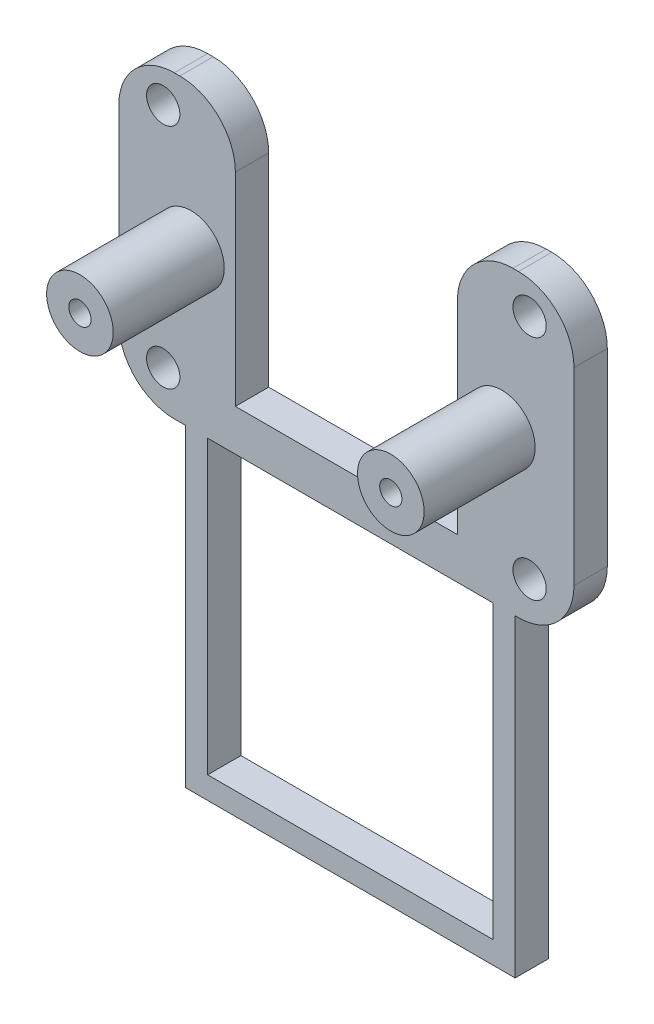
ISO-10303-21;
HEADER;
FILE_DESCRIPTION(('STEP AP214'),'2;1');
FILE_NAME('part.step','',(''),(''),'','','');
FILE_SCHEMA(('AUTOMOTIVE_DESIGN { 1 0 10303 214 1 1 1 1 }'));
ENDSEC;
DATA;
#1=APPLICATION_CONTEXT('core data for automotive mechanical design processes');
#2=APPLICATION_PROTOCOL_DEFINITION('international standard','automotive_design',2000,#1);
#3=PRODUCT_CONTEXT('',#1,'mechanical');
#4=PRODUCT('Part','Part','',(#3));
#5=PRODUCT_RELATED_PRODUCT_CATEGORY('part','',(#4));
#6=PRODUCT_DEFINITION_FORMATION('','',#4);
#7=PRODUCT_DEFINITION_CONTEXT('part definition',#1,'design');
#8=PRODUCT_DEFINITION('design','',#6,#7);
#9=PRODUCT_DEFINITION_SHAPE('','',#8);
#10=(LENGTH_UNIT() NAMED_UNIT(*) SI_UNIT(.MILLI.,.METRE.));
#11=(NAMED_UNIT(*) PLANE_ANGLE_UNIT() SI_UNIT($,.RADIAN.));
#12=(NAMED_UNIT(*) SI_UNIT($,.STERADIAN.) SOLID_ANGLE_UNIT());
#13=UNCERTAINTY_MEASURE_WITH_UNIT(LENGTH_MEASURE(1.E-05),#10,'distance_accuracy_value','');
#14=(GEOMETRIC_REPRESENTATION_CONTEXT(3) GLOBAL_UNCERTAINTY_ASSIGNED_CONTEXT((#13)) GLOBAL_UNIT_ASSIGNED_CONTEXT((#10,
#11,#12)) REPRESENTATION_CONTEXT('',''));
#15=CARTESIAN_POINT('',(0.,0.,0.));
#16=DIRECTION('',(0.,0.,1.));
#17=DIRECTION('',(1.,0.,0.));
#18=AXIS2_PLACEMENT_3D('',#15,#16,#17);
#19=CARTESIAN_POINT('',(0.,0.,3.));
#20=DIRECTION('',(0.,1.,0.));
#21=DIRECTION('',(0.,0.,1.));
#22=AXIS2_PLACEMENT_3D('',#19,#20,#21);
#23=PLANE('',#22);
#24=DIRECTION('',(0.,0.,1.));
#25=VECTOR('',#24,1.);
#26=CARTESIAN_POINT('',(35.7,0.,0.));
#27=LINE('',#26,#25);
#28=CARTESIAN_POINT('',(35.7,0.,0.));
#29=VERTEX_POINT('',#28);
#30=CARTESIAN_POINT('',(35.7,0.,3.));
#31=VERTEX_POINT('',#30);
#32=EDGE_CURVE('E234',#29,#31,#27,.T.);
#33=ORIENTED_EDGE('',*,*,#32,.F.);
#34=DIRECTION('',(1.,0.,0.));
#35=VECTOR('',#34,1.);
#36=CARTESIAN_POINT('',(0.,0.,0.));
#37=LINE('',#36,#35);
#38=CARTESIAN_POINT('',(36.,0.,0.));
#39=VERTEX_POINT('',#38);
#40=EDGE_CURVE('E330',#29,#39,#37,.T.);
#41=ORIENTED_EDGE('',*,*,#40,.T.);
#42=DIRECTION('',(0.,0.,-1.));
#43=VECTOR('',#42,1.);
#44=CARTESIAN_POINT('',(36.,0.,3.));
#45=LINE('',#44,#43);
#46=CARTESIAN_POINT('',(36.,0.,3.));
#47=VERTEX_POINT('',#46);
#48=EDGE_CURVE('E367',#39,#47,#45,.F.);
#49=ORIENTED_EDGE('',*,*,#48,.T.);
#50=DIRECTION('',(1.,0.,0.));
#51=VECTOR('',#50,1.);
#52=CARTESIAN_POINT('',(0.,0.,3.));
#53=LINE('',#52,#51);
#54=EDGE_CURVE('E53',#31,#47,#53,.T.);
#55=ORIENTED_EDGE('',*,*,#54,.F.);
#56=EDGE_LOOP('',(#33,#41,#49,#55));
#57=FACE_BOUND('',#56,.T.);
#58=ADVANCED_FACE('F38',(#57),#23,.F.);
#59=DIRECTION('',(0.,0.,1.));
#60=VECTOR('',#59,1.);
#61=CARTESIAN_POINT('',(8.,0.,0.));
#62=LINE('',#61,#60);
#63=CARTESIAN_POINT('',(8.,0.,0.));
#64=VERTEX_POINT('',#63);
#65=CARTESIAN_POINT('',(8.,0.,3.));
#66=VERTEX_POINT('',#65);
#67=EDGE_CURVE('E244',#64,#66,#62,.T.);
#68=ORIENTED_EDGE('',*,*,#67,.F.);
#69=CARTESIAN_POINT('',(33.7,0.,0.));
#70=VERTEX_POINT('',#69);
#71=EDGE_CURVE('E334',#64,#70,#37,.T.);
#72=ORIENTED_EDGE('',*,*,#71,.T.);
#73=DIRECTION('',(0.,0.,1.));
#74=VECTOR('',#73,1.);
#75=CARTESIAN_POINT('',(33.7,0.,0.));
#76=LINE('',#75,#74);
#77=CARTESIAN_POINT('',(33.7,0.,3.));
#78=VERTEX_POINT('',#77);
#79=EDGE_CURVE('E61',#70,#78,#76,.T.);
#80=ORIENTED_EDGE('',*,*,#79,.T.);
#81=EDGE_CURVE('E301',#66,#78,#53,.T.);
#82=ORIENTED_EDGE('',*,*,#81,.F.);
#83=EDGE_LOOP('',(#68,#72,#80,#82));
#84=FACE_BOUND('',#83,.T.);
#85=ADVANCED_FACE('F487',(#84),#23,.F.);
#86=CARTESIAN_POINT('',(30.5,0.,3.));
#87=DIRECTION('',(-1.,0.,0.));
#88=DIRECTION('',(0.,0.,1.));
#89=AXIS2_PLACEMENT_3D('',#86,#87,#88);
#90=PLANE('',#89);
#91=DIRECTION('',(0.,1.,0.));
#92=VECTOR('',#91,1.);
#93=CARTESIAN_POINT('',(30.5,0.,3.));
#94=LINE('',#93,#92);
#95=CARTESIAN_POINT('',(30.5,3.72727272727273,3.));
#96=VERTEX_POINT('',#95);
#97=CARTESIAN_POINT('',(30.5,22.,3.));
#98=VERTEX_POINT('',#97);
#99=EDGE_CURVE('E280',#96,#98,#94,.T.);
#100=ORIENTED_EDGE('',*,*,#99,.T.);
#101=DIRECTION('',(0.,0.,-1.));
#102=VECTOR('',#101,1.);
#103=CARTESIAN_POINT('',(30.5,22.,3.));
#104=LINE('',#103,#102);
#105=CARTESIAN_POINT('',(30.5,22.,0.));
#106=VERTEX_POINT('',#105);
#107=EDGE_CURVE('E386',#98,#106,#104,.T.);
#108=ORIENTED_EDGE('',*,*,#107,.T.);
#109=DIRECTION('',(0.,1.,0.));
#110=VECTOR('',#109,1.);
#111=CARTESIAN_POINT('',(30.5,0.,0.));
#112=LINE('',#111,#110);
#113=CARTESIAN_POINT('',(30.5,3.72727272727273,0.));
#114=VERTEX_POINT('',#113);
#115=EDGE_CURVE('E315',#114,#106,#112,.T.);
#116=ORIENTED_EDGE('',*,*,#115,.F.);
#117=DIRECTION('',(0.,0.,-1.));
#118=VECTOR('',#117,1.);
#119=CARTESIAN_POINT('',(30.5,3.72727272727273,3.));
#120=LINE('',#119,#118);
#121=EDGE_CURVE('E338',#96,#114,#120,.T.);
#122=ORIENTED_EDGE('',*,*,#121,.F.);
#123=EDGE_LOOP('',(#100,#108,#116,#122));
#124=FACE_BOUND('',#123,.T.);
#125=ADVANCED_FACE('F467',(#124),#90,.T.);
#126=CARTESIAN_POINT('',(0.,3.72727272727273,3.));
#127=DIRECTION('',(0.,1.,0.));
#128=DIRECTION('',(0.,0.,1.));
#129=AXIS2_PLACEMENT_3D('',#126,#127,#128);
#130=PLANE('',#129);
#131=DIRECTION('',(1.,0.,0.));
#132=VECTOR('',#131,1.);
#133=CARTESIAN_POINT('',(0.,3.72727272727273,0.));
#134=LINE('',#133,#132);
#135=CARTESIAN_POINT('',(10.5,3.72727272727273,0.));
#136=VERTEX_POINT('',#135);
#137=EDGE_CURVE('E318',#136,#114,#134,.T.);
#138=ORIENTED_EDGE('',*,*,#137,.F.);
#139=DIRECTION('',(0.,0.,-1.));
#140=VECTOR('',#139,1.);
#141=CARTESIAN_POINT('',(10.5,3.72727272727273,3.));
#142=LINE('',#141,#140);
#143=CARTESIAN_POINT('',(10.5,3.72727272727273,3.));
#144=VERTEX_POINT('',#143);
#145=EDGE_CURVE('E293',#144,#136,#142,.T.);
#146=ORIENTED_EDGE('',*,*,#145,.F.);
#147=DIRECTION('',(1.,0.,0.));
#148=VECTOR('',#147,1.);
#149=CARTESIAN_POINT('',(0.,3.72727272727273,3.));
#150=LINE('',#149,#148);
#151=EDGE_CURVE('E283',#144,#96,#150,.T.);
#152=ORIENTED_EDGE('',*,*,#151,.T.);
#153=ORIENTED_EDGE('',*,*,#121,.T.);
#154=EDGE_LOOP('',(#138,#146,#152,#153));
#155=FACE_BOUND('',#154,.T.);
#156=ADVANCED_FACE('F471',(#155),#130,.T.);
#157=CARTESIAN_POINT('',(10.5,0.,3.));
#158=DIRECTION('',(-1.,0.,0.));
#159=DIRECTION('',(0.,0.,1.));
#160=AXIS2_PLACEMENT_3D('',#157,#158,#159);
#161=PLANE('',#160);
#162=DIRECTION('',(0.,1.,0.));
#163=VECTOR('',#162,1.);
#164=CARTESIAN_POINT('',(10.5,0.,0.));
#165=LINE('',#164,#163);
#166=CARTESIAN_POINT('',(10.5,22.,0.));
#167=VERTEX_POINT('',#166);
#168=EDGE_CURVE('E321',#136,#167,#165,.T.);
#169=ORIENTED_EDGE('',*,*,#168,.T.);
#170=DIRECTION('',(0.,0.,-1.));
#171=VECTOR('',#170,1.);
#172=CARTESIAN_POINT('',(10.5,22.,3.));
#173=LINE('',#172,#171);
#174=CARTESIAN_POINT('',(10.5,22.,3.));
#175=VERTEX_POINT('',#174);
#176=EDGE_CURVE('E11',#167,#175,#173,.F.);
#177=ORIENTED_EDGE('',*,*,#176,.T.);
#178=DIRECTION('',(0.,1.,0.));
#179=VECTOR('',#178,1.);
#180=CARTESIAN_POINT('',(10.5,0.,3.));
#181=LINE('',#180,#179);
#182=EDGE_CURVE('E286',#144,#175,#181,.T.);
#183=ORIENTED_EDGE('',*,*,#182,.F.);
#184=ORIENTED_EDGE('',*,*,#145,.T.);
#185=EDGE_LOOP('',(#169,#177,#183,#184));
#186=FACE_BOUND('',#185,.T.);
#187=ADVANCED_FACE('F476',(#186),#161,.F.);
#188=CARTESIAN_POINT('',(0.,27.,3.));
#189=DIRECTION('',(0.,1.,0.));
#190=DIRECTION('',(0.,0.,1.));
#191=AXIS2_PLACEMENT_3D('',#188,#189,#190);
#192=PLANE('',#191);
#193=DIRECTION('',(1.,0.,0.));
#194=VECTOR('',#193,1.);
#195=CARTESIAN_POINT('',(0.,27.,3.));
#196=LINE('',#195,#194);
#197=CARTESIAN_POINT('',(5.,27.,3.));
#198=VERTEX_POINT('',#197);
#199=CARTESIAN_POINT('',(5.5,27.,3.));
#200=VERTEX_POINT('',#199);
#201=EDGE_CURVE('E289',#198,#200,#196,.T.);
#202=ORIENTED_EDGE('',*,*,#201,.T.);
#203=DIRECTION('',(0.,0.,-1.));
#204=VECTOR('',#203,1.);
#205=CARTESIAN_POINT('',(5.5,27.,0.));
#206=LINE('',#205,#204);
#207=CARTESIAN_POINT('',(5.5,27.,0.));
#208=VERTEX_POINT('',#207);
#209=EDGE_CURVE('E46',#200,#208,#206,.T.);
#210=ORIENTED_EDGE('',*,*,#209,.T.);
#211=DIRECTION('',(1.,0.,0.));
#212=VECTOR('',#211,1.);
#213=CARTESIAN_POINT('',(0.,27.,0.));
#214=LINE('',#213,#212);
#215=CARTESIAN_POINT('',(5.,27.,0.));
#216=VERTEX_POINT('',#215);
#217=EDGE_CURVE('E324',#216,#208,#214,.T.);
#218=ORIENTED_EDGE('',*,*,#217,.F.);
#219=DIRECTION('',(0.,0.,-1.));
#220=VECTOR('',#219,1.);
#221=CARTESIAN_POINT('',(5.,27.,3.));
#222=LINE('',#221,#220);
#223=EDGE_CURVE('E394',#216,#198,#222,.F.);
#224=ORIENTED_EDGE('',*,*,#223,.T.);
#225=EDGE_LOOP('',(#202,#210,#218,#224));
#226=FACE_BOUND('',#225,.T.);
#227=ADVANCED_FACE('F400',(#226),#192,.T.);
#228=CARTESIAN_POINT('',(0.,0.,3.));
#229=DIRECTION('',(-1.,0.,0.));
#230=DIRECTION('',(0.,0.,1.));
#231=AXIS2_PLACEMENT_3D('',#228,#229,#230);
#232=PLANE('',#231);
#233=DIRECTION('',(0.,1.,0.));
#234=VECTOR('',#233,1.);
#235=CARTESIAN_POINT('',(0.,0.,0.));
#236=LINE('',#235,#234);
#237=CARTESIAN_POINT('',(0.,5.,0.));
#238=VERTEX_POINT('',#237);
#239=CARTESIAN_POINT('',(0.,22.,0.));
#240=VERTEX_POINT('',#239);
#241=EDGE_CURVE('E327',#238,#240,#236,.T.);
#242=ORIENTED_EDGE('',*,*,#241,.F.);
#243=DIRECTION('',(0.,0.,-1.));
#244=VECTOR('',#243,1.);
#245=CARTESIAN_POINT('',(0.,5.,3.));
#246=LINE('',#245,#244);
#247=CARTESIAN_POINT('',(0.,5.,3.));
#248=VERTEX_POINT('',#247);
#249=EDGE_CURVE('E392',#238,#248,#246,.F.);
#250=ORIENTED_EDGE('',*,*,#249,.T.);
#251=DIRECTION('',(0.,1.,0.));
#252=VECTOR('',#251,1.);
#253=CARTESIAN_POINT('',(0.,0.,3.));
#254=LINE('',#253,#252);
#255=CARTESIAN_POINT('',(0.,22.,3.));
#256=VERTEX_POINT('',#255);
#257=EDGE_CURVE('E295',#248,#256,#254,.T.);
#258=ORIENTED_EDGE('',*,*,#257,.T.);
#259=DIRECTION('',(0.,0.,-1.));
#260=VECTOR('',#259,1.);
#261=CARTESIAN_POINT('',(0.,22.,3.));
#262=LINE('',#261,#260);
#263=EDGE_CURVE('E389',#256,#240,#262,.T.);
#264=ORIENTED_EDGE('',*,*,#263,.T.);
#265=EDGE_LOOP('',(#242,#250,#258,#264));
#266=FACE_BOUND('',#265,.T.);
#267=ADVANCED_FACE('F413',(#266),#232,.T.);
#268=CARTESIAN_POINT('',(5.,0.,0.));
#269=VERTEX_POINT('',#268);
#270=CARTESIAN_POINT('',(6.,0.,0.));
#271=VERTEX_POINT('',#270);
#272=EDGE_CURVE('E331',#269,#271,#37,.T.);
#273=ORIENTED_EDGE('',*,*,#272,.T.);
#274=DIRECTION('',(0.,0.,1.));
#275=VECTOR('',#274,1.);
#276=CARTESIAN_POINT('',(6.,0.,0.));
#277=LINE('',#276,#275);
#278=CARTESIAN_POINT('',(6.,0.,3.));
#279=VERTEX_POINT('',#278);
#280=EDGE_CURVE('E242',#271,#279,#277,.T.);
#281=ORIENTED_EDGE('',*,*,#280,.T.);
#282=CARTESIAN_POINT('',(5.,0.,3.));
#283=VERTEX_POINT('',#282);
#284=EDGE_CURVE('E298',#283,#279,#53,.T.);
#285=ORIENTED_EDGE('',*,*,#284,.F.);
#286=DIRECTION('',(0.,0.,-1.));
#287=VECTOR('',#286,1.);
#288=CARTESIAN_POINT('',(5.,0.,0.));
#289=LINE('',#288,#287);
#290=EDGE_CURVE('E364',#283,#269,#289,.T.);
#291=ORIENTED_EDGE('',*,*,#290,.T.);
#292=EDGE_LOOP('',(#273,#281,#285,#291));
#293=FACE_BOUND('',#292,.T.);
#294=ADVANCED_FACE('F426',(#293),#23,.F.);
#295=CARTESIAN_POINT('',(41.,0.,3.));
#296=DIRECTION('',(-1.,0.,0.));
#297=DIRECTION('',(0.,0.,1.));
#298=AXIS2_PLACEMENT_3D('',#295,#296,#297);
#299=PLANE('',#298);
#300=DIRECTION('',(0.,1.,0.));
#301=VECTOR('',#300,1.);
#302=CARTESIAN_POINT('',(41.,0.,3.));
#303=LINE('',#302,#301);
#304=CARTESIAN_POINT('',(41.,5.,3.));
#305=VERTEX_POINT('',#304);
#306=CARTESIAN_POINT('',(41.,22.,3.));
#307=VERTEX_POINT('',#306);
#308=EDGE_CURVE('E294',#305,#307,#303,.T.);
#309=ORIENTED_EDGE('',*,*,#308,.F.);
#310=DIRECTION('',(0.,0.,-1.));
#311=VECTOR('',#310,1.);
#312=CARTESIAN_POINT('',(41.,5.,3.));
#313=LINE('',#312,#311);
#314=CARTESIAN_POINT('',(41.,5.,0.));
#315=VERTEX_POINT('',#314);
#316=EDGE_CURVE('E348',#305,#315,#313,.T.);
#317=ORIENTED_EDGE('',*,*,#316,.T.);
#318=DIRECTION('',(0.,1.,0.));
#319=VECTOR('',#318,1.);
#320=CARTESIAN_POINT('',(41.,0.,0.));
#321=LINE('',#320,#319);
#322=CARTESIAN_POINT('',(41.,22.,0.));
#323=VERTEX_POINT('',#322);
#324=EDGE_CURVE('E333',#315,#323,#321,.T.);
#325=ORIENTED_EDGE('',*,*,#324,.T.);
#326=DIRECTION('',(0.,0.,-1.));
#327=VECTOR('',#326,1.);
#328=CARTESIAN_POINT('',(41.,22.,3.));
#329=LINE('',#328,#327);
#330=EDGE_CURVE('E346',#323,#307,#329,.F.);
#331=ORIENTED_EDGE('',*,*,#330,.T.);
#332=EDGE_LOOP('',(#309,#317,#325,#331));
#333=FACE_BOUND('',#332,.T.);
#334=ADVANCED_FACE('F449',(#333),#299,.F.);
#335=CARTESIAN_POINT('',(4.,23.9980761177991,3.));
#336=DIRECTION('',(0.,0.,-1.));
#337=DIRECTION('',(-1.,0.,0.));
#338=AXIS2_PLACEMENT_3D('',#335,#336,#337);
#339=CYLINDRICAL_SURFACE('',#338,1.5);
#340=CARTESIAN_POINT('',(4.,23.9980761177991,3.));
#341=DIRECTION('',(0.,0.,1.));
#342=DIRECTION('',(1.,0.,0.));
#343=AXIS2_PLACEMENT_3D('',#340,#341,#342);
#344=CIRCLE('',#343,1.5);
#345=CARTESIAN_POINT('',(5.5,23.9980761177991,3.));
#346=VERTEX_POINT('',#345);
#347=EDGE_CURVE('E277',#346,#346,#344,.T.);
#348=ORIENTED_EDGE('',*,*,#347,.T.);
#349=EDGE_LOOP('',(#348));
#350=FACE_BOUND('',#349,.T.);
#351=CARTESIAN_POINT('',(4.,23.9980761177991,0.));
#352=DIRECTION('',(0.,0.,1.));
#353=DIRECTION('',(1.,0.,0.));
#354=AXIS2_PLACEMENT_3D('',#351,#352,#353);
#355=CIRCLE('',#354,1.5);
#356=CARTESIAN_POINT('',(5.5,23.9980761177991,0.));
#357=VERTEX_POINT('',#356);
#358=EDGE_CURVE('E312',#357,#357,#355,.T.);
#359=ORIENTED_EDGE('',*,*,#358,.F.);
#360=EDGE_LOOP('',(#359));
#361=FACE_BOUND('',#360,.T.);
#362=ADVANCED_FACE('F498',(#350,#361),#339,.F.);
#363=CARTESIAN_POINT('',(4.,3.49807611779909,3.));
#364=DIRECTION('',(0.,0.,-1.));
#365=DIRECTION('',(-1.,0.,0.));
#366=AXIS2_PLACEMENT_3D('',#363,#364,#365);
#367=CYLINDRICAL_SURFACE('',#366,1.5);
#368=CARTESIAN_POINT('',(4.,3.49807611779909,3.));
#369=DIRECTION('',(0.,0.,1.));
#370=DIRECTION('',(1.,0.,0.));
#371=AXIS2_PLACEMENT_3D('',#368,#369,#370);
#372=CIRCLE('',#371,1.5);
#373=CARTESIAN_POINT('',(5.5,3.49807611779909,3.));
#374=VERTEX_POINT('',#373);
#375=EDGE_CURVE('E274',#374,#374,#372,.T.);
#376=ORIENTED_EDGE('',*,*,#375,.T.);
#377=EDGE_LOOP('',(#376));
#378=FACE_BOUND('',#377,.T.);
#379=CARTESIAN_POINT('',(4.,3.49807611779909,0.));
#380=DIRECTION('',(0.,0.,1.));
#381=DIRECTION('',(1.,0.,0.));
#382=AXIS2_PLACEMENT_3D('',#379,#380,#381);
#383=CIRCLE('',#382,1.5);
#384=CARTESIAN_POINT('',(5.5,3.49807611779909,0.));
#385=VERTEX_POINT('',#384);
#386=EDGE_CURVE('E309',#385,#385,#383,.T.);
#387=ORIENTED_EDGE('',*,*,#386,.F.);
#388=EDGE_LOOP('',(#387));
#389=FACE_BOUND('',#388,.T.);
#390=ADVANCED_FACE('F624',(#378,#389),#367,.F.);
#391=CARTESIAN_POINT('',(36.9999999298227,3.5002282572057,3.));
#392=DIRECTION('',(0.,0.,-1.));
#393=DIRECTION('',(-1.,0.,0.));
#394=AXIS2_PLACEMENT_3D('',#391,#392,#393);
#395=CYLINDRICAL_SURFACE('',#394,1.5);
#396=CARTESIAN_POINT('',(36.9999999298227,3.5002282572057,3.));
#397=DIRECTION('',(0.,0.,1.));
#398=DIRECTION('',(1.,0.,0.));
#399=AXIS2_PLACEMENT_3D('',#396,#397,#398);
#400=CIRCLE('',#399,1.5);
#401=CARTESIAN_POINT('',(38.4999999298227,3.5002282572057,3.));
#402=VERTEX_POINT('',#401);
#403=EDGE_CURVE('E270',#402,#402,#400,.T.);
#404=ORIENTED_EDGE('',*,*,#403,.T.);
#405=EDGE_LOOP('',(#404));
#406=FACE_BOUND('',#405,.T.);
#407=CARTESIAN_POINT('',(36.9999999298227,3.5002282572057,0.));
#408=DIRECTION('',(0.,0.,1.));
#409=DIRECTION('',(1.,0.,0.));
#410=AXIS2_PLACEMENT_3D('',#407,#408,#409);
#411=CIRCLE('',#410,1.5);
#412=CARTESIAN_POINT('',(38.4999999298227,3.5002282572057,0.));
#413=VERTEX_POINT('',#412);
#414=EDGE_CURVE('E306',#413,#413,#411,.T.);
#415=ORIENTED_EDGE('',*,*,#414,.F.);
#416=EDGE_LOOP('',(#415));
#417=FACE_BOUND('',#416,.T.);
#418=ADVANCED_FACE('F612',(#406,#417),#395,.F.);
#419=CARTESIAN_POINT('',(36.9999999298227,23.9983043750048,3.));
#420=DIRECTION('',(0.,0.,-1.));
#421=DIRECTION('',(-1.,0.,0.));
#422=AXIS2_PLACEMENT_3D('',#419,#420,#421);
#423=CYLINDRICAL_SURFACE('',#422,1.5);
#424=CARTESIAN_POINT('',(36.9999999298227,23.9983043750048,3.));
#425=DIRECTION('',(0.,0.,1.));
#426=DIRECTION('',(1.,0.,0.));
#427=AXIS2_PLACEMENT_3D('',#424,#425,#426);
#428=CIRCLE('',#427,1.5);
#429=CARTESIAN_POINT('',(38.4999999298227,23.9983043750048,3.));
#430=VERTEX_POINT('',#429);
#431=EDGE_CURVE('E267',#430,#430,#428,.T.);
#432=ORIENTED_EDGE('',*,*,#431,.T.);
#433=EDGE_LOOP('',(#432));
#434=FACE_BOUND('',#433,.T.);
#435=CARTESIAN_POINT('',(36.9999999298227,23.9983043750048,0.));
#436=DIRECTION('',(0.,0.,1.));
#437=DIRECTION('',(1.,0.,0.));
#438=AXIS2_PLACEMENT_3D('',#435,#436,#437);
#439=CIRCLE('',#438,1.5);
#440=CARTESIAN_POINT('',(38.4999999298227,23.9983043750048,0.));
#441=VERTEX_POINT('',#440);
#442=EDGE_CURVE('E264',#441,#441,#439,.T.);
#443=ORIENTED_EDGE('',*,*,#442,.F.);
#444=EDGE_LOOP('',(#443));
#445=FACE_BOUND('',#444,.T.);
#446=ADVANCED_FACE('F607',(#434,#445),#423,.F.);
#447=CARTESIAN_POINT('',(35.5,27.,3.));
#448=VERTEX_POINT('',#447);
#449=CARTESIAN_POINT('',(36.,27.,3.));
#450=VERTEX_POINT('',#449);
#451=EDGE_CURVE('E290',#448,#450,#196,.T.);
#452=ORIENTED_EDGE('',*,*,#451,.T.);
#453=DIRECTION('',(0.,0.,-1.));
#454=VECTOR('',#453,1.);
#455=CARTESIAN_POINT('',(36.,27.,0.));
#456=LINE('',#455,#454);
#457=CARTESIAN_POINT('',(36.,27.,0.));
#458=VERTEX_POINT('',#457);
#459=EDGE_CURVE('E383',#450,#458,#456,.T.);
#460=ORIENTED_EDGE('',*,*,#459,.T.);
#461=CARTESIAN_POINT('',(35.5,27.,0.));
#462=VERTEX_POINT('',#461);
#463=EDGE_CURVE('E271',#462,#458,#214,.T.);
#464=ORIENTED_EDGE('',*,*,#463,.F.);
#465=DIRECTION('',(0.,0.,-1.));
#466=VECTOR('',#465,1.);
#467=CARTESIAN_POINT('',(35.5,27.,3.));
#468=LINE('',#467,#466);
#469=EDGE_CURVE('E381',#462,#448,#468,.F.);
#470=ORIENTED_EDGE('',*,*,#469,.T.);
#471=EDGE_LOOP('',(#452,#460,#464,#470));
#472=FACE_BOUND('',#471,.T.);
#473=ADVANCED_FACE('F457',(#472),#192,.T.);
#474=CARTESIAN_POINT('',(0.,0.,3.));
#475=DIRECTION('',(0.,0.,1.));
#476=DIRECTION('',(1.,0.,0.));
#477=AXIS2_PLACEMENT_3D('',#474,#475,#476);
#478=PLANE('',#477);
#479=DIRECTION('',(0.,-1.,0.));
#480=VECTOR('',#479,1.);
#481=CARTESIAN_POINT('',(35.7,0.,3.));
#482=LINE('',#481,#480);
#483=CARTESIAN_POINT('',(35.7,-28.26,3.));
#484=VERTEX_POINT('',#483);
#485=EDGE_CURVE('E209',#31,#484,#482,.T.);
#486=ORIENTED_EDGE('',*,*,#485,.F.);
#487=ORIENTED_EDGE('',*,*,#54,.T.);
#488=CARTESIAN_POINT('',(36.,5.,3.));
#489=DIRECTION('',(0.,0.,1.));
#490=DIRECTION('',(1.,0.,0.));
#491=AXIS2_PLACEMENT_3D('',#488,#489,#490);
#492=CIRCLE('',#491,5.);
#493=EDGE_CURVE('E379',#47,#305,#492,.T.);
#494=ORIENTED_EDGE('',*,*,#493,.T.);
#495=ORIENTED_EDGE('',*,*,#308,.T.);
#496=CARTESIAN_POINT('',(36.,22.,3.));
#497=DIRECTION('',(0.,0.,1.));
#498=DIRECTION('',(1.,0.,0.));
#499=AXIS2_PLACEMENT_3D('',#496,#497,#498);
#500=CIRCLE('',#499,5.);
#501=EDGE_CURVE('E377',#307,#450,#500,.T.);
#502=ORIENTED_EDGE('',*,*,#501,.T.);
#503=ORIENTED_EDGE('',*,*,#451,.F.);
#504=CARTESIAN_POINT('',(35.5,22.,3.));
#505=DIRECTION('',(0.,0.,1.));
#506=DIRECTION('',(1.,0.,0.));
#507=AXIS2_PLACEMENT_3D('',#504,#505,#506);
#508=CIRCLE('',#507,5.);
#509=EDGE_CURVE('E375',#448,#98,#508,.T.);
#510=ORIENTED_EDGE('',*,*,#509,.T.);
#511=ORIENTED_EDGE('',*,*,#99,.F.);
#512=ORIENTED_EDGE('',*,*,#151,.F.);
#513=ORIENTED_EDGE('',*,*,#182,.T.);
#514=CARTESIAN_POINT('',(5.5,22.,3.));
#515=DIRECTION('',(0.,0.,1.));
#516=DIRECTION('',(1.,0.,0.));
#517=AXIS2_PLACEMENT_3D('',#514,#515,#516);
#518=CIRCLE('',#517,5.);
#519=EDGE_CURVE('E371',#175,#200,#518,.T.);
#520=ORIENTED_EDGE('',*,*,#519,.T.);
#521=ORIENTED_EDGE('',*,*,#201,.F.);
#522=CARTESIAN_POINT('',(5.,22.,3.));
#523=DIRECTION('',(0.,0.,1.));
#524=DIRECTION('',(1.,0.,0.));
#525=AXIS2_PLACEMENT_3D('',#522,#523,#524);
#526=CIRCLE('',#525,5.);
#527=EDGE_CURVE('E369',#198,#256,#526,.T.);
#528=ORIENTED_EDGE('',*,*,#527,.T.);
#529=ORIENTED_EDGE('',*,*,#257,.F.);
#530=CARTESIAN_POINT('',(5.,5.,3.));
#531=DIRECTION('',(0.,0.,1.));
#532=DIRECTION('',(1.,0.,0.));
#533=AXIS2_PLACEMENT_3D('',#530,#531,#532);
#534=CIRCLE('',#533,5.);
#535=EDGE_CURVE('E373',#248,#283,#534,.T.);
#536=ORIENTED_EDGE('',*,*,#535,.T.);
#537=ORIENTED_EDGE('',*,*,#284,.T.);
#538=DIRECTION('',(0.,-1.,0.));
#539=VECTOR('',#538,1.);
#540=CARTESIAN_POINT('',(6.,0.,3.));
#541=LINE('',#540,#539);
#542=CARTESIAN_POINT('',(6.,-28.26,3.));
#543=VERTEX_POINT('',#542);
#544=EDGE_CURVE('E229',#279,#543,#541,.T.);
#545=ORIENTED_EDGE('',*,*,#544,.T.);
#546=DIRECTION('',(1.,0.,0.));
#547=VECTOR('',#546,1.);
#548=CARTESIAN_POINT('',(0.,-28.26,3.));
#549=LINE('',#548,#547);
#550=EDGE_CURVE('E212',#543,#484,#549,.T.);
#551=ORIENTED_EDGE('',*,*,#550,.T.);
#552=EDGE_LOOP('',(#486,#487,#494,#495,#502,#503,#510,#511,#512,#513,#520,#521,#528,#529,#536,
#537,#545,#551));
#553=FACE_BOUND('',#552,.T.);
#554=CARTESIAN_POINT('',(34.5,14.,3.));
#555=DIRECTION('',(0.,0.,1.));
#556=DIRECTION('',(1.,0.,0.));
#557=AXIS2_PLACEMENT_3D('',#554,#555,#556);
#558=CIRCLE('',#557,3.);
#559=CARTESIAN_POINT('',(37.5,14.,3.));
#560=VERTEX_POINT('',#559);
#561=EDGE_CURVE('E251',#560,#560,#558,.T.);
#562=ORIENTED_EDGE('',*,*,#561,.F.);
#563=EDGE_LOOP('',(#562));
#564=FACE_BOUND('',#563,.T.);
#565=CARTESIAN_POINT('',(6.5,14.,3.));
#566=DIRECTION('',(0.,0.,1.));
#567=DIRECTION('',(1.,0.,0.));
#568=AXIS2_PLACEMENT_3D('',#565,#566,#567);
#569=CIRCLE('',#568,3.);
#570=CARTESIAN_POINT('',(9.5,14.,3.));
#571=VERTEX_POINT('',#570);
#572=EDGE_CURVE('E260',#571,#571,#569,.T.);
#573=ORIENTED_EDGE('',*,*,#572,.F.);
#574=EDGE_LOOP('',(#573));
#575=FACE_BOUND('',#574,.T.);
#576=ORIENTED_EDGE('',*,*,#431,.F.);
#577=EDGE_LOOP('',(#576));
#578=FACE_BOUND('',#577,.T.);
#579=ORIENTED_EDGE('',*,*,#403,.F.);
#580=EDGE_LOOP('',(#579));
#581=FACE_BOUND('',#580,.T.);
#582=ORIENTED_EDGE('',*,*,#375,.F.);
#583=EDGE_LOOP('',(#582));
#584=FACE_BOUND('',#583,.T.);
#585=ORIENTED_EDGE('',*,*,#347,.F.);
#586=EDGE_LOOP('',(#585));
#587=FACE_BOUND('',#586,.T.);
#588=ORIENTED_EDGE('',*,*,#81,.T.);
#589=DIRECTION('',(0.,-1.,0.));
#590=VECTOR('',#589,1.);
#591=CARTESIAN_POINT('',(33.7,0.,3.));
#592=LINE('',#591,#590);
#593=CARTESIAN_POINT('',(33.7,-26.26,3.));
#594=VERTEX_POINT('',#593);
#595=EDGE_CURVE('E224',#78,#594,#592,.T.);
#596=ORIENTED_EDGE('',*,*,#595,.T.);
#597=DIRECTION('',(1.,0.,0.));
#598=VECTOR('',#597,1.);
#599=CARTESIAN_POINT('',(0.,-26.26,3.));
#600=LINE('',#599,#598);
#601=CARTESIAN_POINT('',(8.,-26.26,3.));
#602=VERTEX_POINT('',#601);
#603=EDGE_CURVE('E202',#602,#594,#600,.T.);
#604=ORIENTED_EDGE('',*,*,#603,.F.);
#605=DIRECTION('',(0.,-1.,0.));
#606=VECTOR('',#605,1.);
#607=CARTESIAN_POINT('',(8.,0.,3.));
#608=LINE('',#607,#606);
#609=EDGE_CURVE('E227',#66,#602,#608,.T.);
#610=ORIENTED_EDGE('',*,*,#609,.F.);
#611=EDGE_LOOP('',(#588,#596,#604,#610));
#612=FACE_BOUND('',#611,.T.);
#613=ADVANCED_FACE('F418',(#553,#564,#575,#578,#581,#584,#587,#612),#478,.T.);
#614=CARTESIAN_POINT('',(0.,0.,0.));
#615=DIRECTION('',(0.,0.,1.));
#616=DIRECTION('',(1.,0.,0.));
#617=AXIS2_PLACEMENT_3D('',#614,#615,#616);
#618=PLANE('',#617);
#619=ORIENTED_EDGE('',*,*,#40,.F.);
#620=DIRECTION('',(0.,-1.,0.));
#621=VECTOR('',#620,1.);
#622=CARTESIAN_POINT('',(35.7,0.,0.));
#623=LINE('',#622,#621);
#624=CARTESIAN_POINT('',(35.7,-28.26,0.));
#625=VERTEX_POINT('',#624);
#626=EDGE_CURVE('E222',#29,#625,#623,.T.);
#627=ORIENTED_EDGE('',*,*,#626,.T.);
#628=DIRECTION('',(1.,0.,0.));
#629=VECTOR('',#628,1.);
#630=CARTESIAN_POINT('',(0.,-28.26,0.));
#631=LINE('',#630,#629);
#632=CARTESIAN_POINT('',(6.,-28.26,0.));
#633=VERTEX_POINT('',#632);
#634=EDGE_CURVE('E219',#633,#625,#631,.T.);
#635=ORIENTED_EDGE('',*,*,#634,.F.);
#636=DIRECTION('',(0.,-1.,0.));
#637=VECTOR('',#636,1.);
#638=CARTESIAN_POINT('',(6.,0.,0.));
#639=LINE('',#638,#637);
#640=EDGE_CURVE('E216',#271,#633,#639,.T.);
#641=ORIENTED_EDGE('',*,*,#640,.F.);
#642=ORIENTED_EDGE('',*,*,#272,.F.);
#643=CARTESIAN_POINT('',(5.,5.,0.));
#644=DIRECTION('',(0.,0.,1.));
#645=DIRECTION('',(1.,0.,0.));
#646=AXIS2_PLACEMENT_3D('',#643,#644,#645);
#647=CIRCLE('',#646,5.);
#648=EDGE_CURVE('E355',#269,#238,#647,.F.);
#649=ORIENTED_EDGE('',*,*,#648,.T.);
#650=ORIENTED_EDGE('',*,*,#241,.T.);
#651=CARTESIAN_POINT('',(5.,22.,0.));
#652=DIRECTION('',(0.,0.,1.));
#653=DIRECTION('',(1.,0.,0.));
#654=AXIS2_PLACEMENT_3D('',#651,#652,#653);
#655=CIRCLE('',#654,5.);
#656=EDGE_CURVE('E351',#240,#216,#655,.F.);
#657=ORIENTED_EDGE('',*,*,#656,.T.);
#658=ORIENTED_EDGE('',*,*,#217,.T.);
#659=CARTESIAN_POINT('',(5.5,22.,0.));
#660=DIRECTION('',(0.,0.,1.));
#661=DIRECTION('',(1.,0.,0.));
#662=AXIS2_PLACEMENT_3D('',#659,#660,#661);
#663=CIRCLE('',#662,5.);
#664=EDGE_CURVE('E353',#208,#167,#663,.F.);
#665=ORIENTED_EDGE('',*,*,#664,.T.);
#666=ORIENTED_EDGE('',*,*,#168,.F.);
#667=ORIENTED_EDGE('',*,*,#137,.T.);
#668=ORIENTED_EDGE('',*,*,#115,.T.);
#669=CARTESIAN_POINT('',(35.5,22.,0.));
#670=DIRECTION('',(0.,0.,1.));
#671=DIRECTION('',(1.,0.,0.));
#672=AXIS2_PLACEMENT_3D('',#669,#670,#671);
#673=CIRCLE('',#672,5.);
#674=EDGE_CURVE('E357',#106,#462,#673,.F.);
#675=ORIENTED_EDGE('',*,*,#674,.T.);
#676=ORIENTED_EDGE('',*,*,#463,.T.);
#677=CARTESIAN_POINT('',(36.,22.,0.));
#678=DIRECTION('',(0.,0.,1.));
#679=DIRECTION('',(1.,0.,0.));
#680=AXIS2_PLACEMENT_3D('',#677,#678,#679);
#681=CIRCLE('',#680,5.);
#682=EDGE_CURVE('E359',#458,#323,#681,.F.);
#683=ORIENTED_EDGE('',*,*,#682,.T.);
#684=ORIENTED_EDGE('',*,*,#324,.F.);
#685=CARTESIAN_POINT('',(36.,5.,0.));
#686=DIRECTION('',(0.,0.,1.));
#687=DIRECTION('',(1.,0.,0.));
#688=AXIS2_PLACEMENT_3D('',#685,#686,#687);
#689=CIRCLE('',#688,5.);
#690=EDGE_CURVE('E361',#315,#39,#689,.F.);
#691=ORIENTED_EDGE('',*,*,#690,.T.);
#692=EDGE_LOOP('',(#619,#627,#635,#641,#642,#649,#650,#657,#658,#665,#666,#667,#668,#675,#676,
#683,#684,#691));
#693=FACE_BOUND('',#692,.T.);
#694=ORIENTED_EDGE('',*,*,#442,.T.);
#695=EDGE_LOOP('',(#694));
#696=FACE_BOUND('',#695,.T.);
#697=ORIENTED_EDGE('',*,*,#414,.T.);
#698=EDGE_LOOP('',(#697));
#699=FACE_BOUND('',#698,.T.);
#700=ORIENTED_EDGE('',*,*,#386,.T.);
#701=EDGE_LOOP('',(#700));
#702=FACE_BOUND('',#701,.T.);
#703=ORIENTED_EDGE('',*,*,#358,.T.);
#704=EDGE_LOOP('',(#703));
#705=FACE_BOUND('',#704,.T.);
#706=DIRECTION('',(0.,-1.,0.));
#707=VECTOR('',#706,1.);
#708=CARTESIAN_POINT('',(33.7,0.,0.));
#709=LINE('',#708,#707);
#710=CARTESIAN_POINT('',(33.7,-26.26,0.));
#711=VERTEX_POINT('',#710);
#712=EDGE_CURVE('E191',#70,#711,#709,.T.);
#713=ORIENTED_EDGE('',*,*,#712,.F.);
#714=ORIENTED_EDGE('',*,*,#71,.F.);
#715=DIRECTION('',(0.,-1.,0.));
#716=VECTOR('',#715,1.);
#717=CARTESIAN_POINT('',(8.,0.,0.));
#718=LINE('',#717,#716);
#719=CARTESIAN_POINT('',(8.,-26.26,0.));
#720=VERTEX_POINT('',#719);
#721=EDGE_CURVE('E193',#64,#720,#718,.T.);
#722=ORIENTED_EDGE('',*,*,#721,.T.);
#723=DIRECTION('',(1.,0.,0.));
#724=VECTOR('',#723,1.);
#725=CARTESIAN_POINT('',(0.,-26.26,0.));
#726=LINE('',#725,#724);
#727=EDGE_CURVE('E187',#720,#711,#726,.T.);
#728=ORIENTED_EDGE('',*,*,#727,.T.);
#729=EDGE_LOOP('',(#713,#714,#722,#728));
#730=FACE_BOUND('',#729,.T.);
#731=ADVANCED_FACE('F189',(#693,#696,#699,#702,#705,#730),#618,.F.);
#732=CARTESIAN_POINT('',(6.5,14.,13.));
#733=DIRECTION('',(0.,0.,1.));
#734=DIRECTION('',(1.,0.,0.));
#735=AXIS2_PLACEMENT_3D('',#732,#733,#734);
#736=PLANE('',#735);
#737=CARTESIAN_POINT('',(6.5,14.,13.));
#738=DIRECTION('',(0.,0.,1.));
#739=DIRECTION('',(1.,0.,0.));
#740=AXIS2_PLACEMENT_3D('',#737,#738,#739);
#741=CIRCLE('',#740,3.);
#742=CARTESIAN_POINT('',(9.5,14.,13.));
#743=VERTEX_POINT('',#742);
#744=EDGE_CURVE('E261',#743,#743,#741,.T.);
#745=ORIENTED_EDGE('',*,*,#744,.T.);
#746=EDGE_LOOP('',(#745));
#747=FACE_BOUND('',#746,.T.);
#748=CARTESIAN_POINT('',(6.5,14.,13.));
#749=DIRECTION('',(0.,0.,1.));
#750=DIRECTION('',(1.,0.,0.));
#751=AXIS2_PLACEMENT_3D('',#748,#749,#750);
#752=CIRCLE('',#751,1.);
#753=CARTESIAN_POINT('',(7.5,14.,13.));
#754=VERTEX_POINT('',#753);
#755=EDGE_CURVE('E255',#754,#754,#752,.T.);
#756=ORIENTED_EDGE('',*,*,#755,.F.);
#757=EDGE_LOOP('',(#756));
#758=FACE_BOUND('',#757,.T.);
#759=ADVANCED_FACE('F592',(#747,#758),#736,.T.);
#760=CARTESIAN_POINT('',(6.5,14.,13.));
#761=DIRECTION('',(0.,0.,-1.));
#762=DIRECTION('',(-1.,0.,0.));
#763=AXIS2_PLACEMENT_3D('',#760,#761,#762);
#764=CYLINDRICAL_SURFACE('',#763,3.);
#765=ORIENTED_EDGE('',*,*,#744,.F.);
#766=EDGE_LOOP('',(#765));
#767=FACE_BOUND('',#766,.T.);
#768=ORIENTED_EDGE('',*,*,#572,.T.);
#769=EDGE_LOOP('',(#768));
#770=FACE_BOUND('',#769,.T.);
#771=ADVANCED_FACE('F582',(#767,#770),#764,.T.);
#772=CARTESIAN_POINT('',(6.5,14.,13.));
#773=DIRECTION('',(0.,0.,-1.));
#774=DIRECTION('',(-1.,0.,0.));
#775=AXIS2_PLACEMENT_3D('',#772,#773,#774);
#776=CYLINDRICAL_SURFACE('',#775,1.);
#777=ORIENTED_EDGE('',*,*,#755,.T.);
#778=EDGE_LOOP('',(#777));
#779=FACE_BOUND('',#778,.T.);
#780=CARTESIAN_POINT('',(6.5,14.,3.));
#781=DIRECTION('',(0.,0.,1.));
#782=DIRECTION('',(1.,0.,0.));
#783=AXIS2_PLACEMENT_3D('',#780,#781,#782);
#784=CIRCLE('',#783,1.);
#785=CARTESIAN_POINT('',(7.5,14.,3.));
#786=VERTEX_POINT('',#785);
#787=EDGE_CURVE('E340',#786,#786,#784,.F.);
#788=ORIENTED_EDGE('',*,*,#787,.T.);
#789=EDGE_LOOP('',(#788));
#790=FACE_BOUND('',#789,.T.);
#791=ADVANCED_FACE('F573',(#779,#790),#776,.F.);
#792=ORIENTED_EDGE('',*,*,#787,.F.);
#793=EDGE_LOOP('',(#792));
#794=FACE_BOUND('',#793,.T.);
#795=ADVANCED_FACE('F532',(#794),#478,.T.);
#796=CARTESIAN_POINT('',(34.5,14.,13.));
#797=DIRECTION('',(0.,0.,1.));
#798=DIRECTION('',(1.,0.,0.));
#799=AXIS2_PLACEMENT_3D('',#796,#797,#798);
#800=PLANE('',#799);
#801=CARTESIAN_POINT('',(34.5,14.,13.));
#802=DIRECTION('',(0.,0.,1.));
#803=DIRECTION('',(1.,0.,0.));
#804=AXIS2_PLACEMENT_3D('',#801,#802,#803);
#805=CIRCLE('',#804,3.);
#806=CARTESIAN_POINT('',(37.5,14.,13.));
#807=VERTEX_POINT('',#806);
#808=EDGE_CURVE('E252',#807,#807,#805,.T.);
#809=ORIENTED_EDGE('',*,*,#808,.T.);
#810=EDGE_LOOP('',(#809));
#811=FACE_BOUND('',#810,.T.);
#812=CARTESIAN_POINT('',(34.5,14.,13.));
#813=DIRECTION('',(0.,0.,1.));
#814=DIRECTION('',(1.,0.,0.));
#815=AXIS2_PLACEMENT_3D('',#812,#813,#814);
#816=CIRCLE('',#815,0.999999999999998);
#817=CARTESIAN_POINT('',(35.5,14.,13.));
#818=VERTEX_POINT('',#817);
#819=EDGE_CURVE('E237',#818,#818,#816,.T.);
#820=ORIENTED_EDGE('',*,*,#819,.F.);
#821=EDGE_LOOP('',(#820));
#822=FACE_BOUND('',#821,.T.);
#823=ADVANCED_FACE('F554',(#811,#822),#800,.T.);
#824=CARTESIAN_POINT('',(34.5,14.,13.));
#825=DIRECTION('',(0.,0.,-1.));
#826=DIRECTION('',(-1.,0.,0.));
#827=AXIS2_PLACEMENT_3D('',#824,#825,#826);
#828=CYLINDRICAL_SURFACE('',#827,3.);
#829=ORIENTED_EDGE('',*,*,#808,.F.);
#830=EDGE_LOOP('',(#829));
#831=FACE_BOUND('',#830,.T.);
#832=ORIENTED_EDGE('',*,*,#561,.T.);
#833=EDGE_LOOP('',(#832));
#834=FACE_BOUND('',#833,.T.);
#835=ADVANCED_FACE('F543',(#831,#834),#828,.T.);
#836=CARTESIAN_POINT('',(34.5,14.,13.));
#837=DIRECTION('',(0.,0.,-1.));
#838=DIRECTION('',(-1.,0.,0.));
#839=AXIS2_PLACEMENT_3D('',#836,#837,#838);
#840=CYLINDRICAL_SURFACE('',#839,0.999999999999998);
#841=ORIENTED_EDGE('',*,*,#819,.T.);
#842=EDGE_LOOP('',(#841));
#843=FACE_BOUND('',#842,.T.);
#844=CARTESIAN_POINT('',(34.5,14.,3.));
#845=DIRECTION('',(0.,0.,1.));
#846=DIRECTION('',(1.,0.,0.));
#847=AXIS2_PLACEMENT_3D('',#844,#845,#846);
#848=CIRCLE('',#847,0.999999999999998);
#849=CARTESIAN_POINT('',(35.5,14.,3.));
#850=VERTEX_POINT('',#849);
#851=EDGE_CURVE('E343',#850,#850,#848,.F.);
#852=ORIENTED_EDGE('',*,*,#851,.T.);
#853=EDGE_LOOP('',(#852));
#854=FACE_BOUND('',#853,.T.);
#855=ADVANCED_FACE('F529',(#843,#854),#840,.F.);
#856=ORIENTED_EDGE('',*,*,#851,.F.);
#857=EDGE_LOOP('',(#856));
#858=FACE_BOUND('',#857,.T.);
#859=ADVANCED_FACE('F524',(#858),#478,.T.);
#860=CARTESIAN_POINT('',(36.,5.,3.));
#861=DIRECTION('',(0.,0.,-1.));
#862=DIRECTION('',(-1.,0.,0.));
#863=AXIS2_PLACEMENT_3D('',#860,#861,#862);
#864=CYLINDRICAL_SURFACE('',#863,5.);
#865=ORIENTED_EDGE('',*,*,#493,.F.);
#866=ORIENTED_EDGE('',*,*,#48,.F.);
#867=ORIENTED_EDGE('',*,*,#690,.F.);
#868=ORIENTED_EDGE('',*,*,#316,.F.);
#869=EDGE_LOOP('',(#865,#866,#867,#868));
#870=FACE_BOUND('',#869,.T.);
#871=ADVANCED_FACE('F445',(#870),#864,.T.);
#872=CARTESIAN_POINT('',(36.,22.,3.));
#873=DIRECTION('',(0.,0.,1.));
#874=DIRECTION('',(1.,0.,0.));
#875=AXIS2_PLACEMENT_3D('',#872,#873,#874);
#876=CYLINDRICAL_SURFACE('',#875,5.);
#877=ORIENTED_EDGE('',*,*,#501,.F.);
#878=ORIENTED_EDGE('',*,*,#330,.F.);
#879=ORIENTED_EDGE('',*,*,#682,.F.);
#880=ORIENTED_EDGE('',*,*,#459,.F.);
#881=EDGE_LOOP('',(#877,#878,#879,#880));
#882=FACE_BOUND('',#881,.T.);
#883=ADVANCED_FACE('F452',(#882),#876,.T.);
#884=CARTESIAN_POINT('',(35.5,22.,3.));
#885=DIRECTION('',(0.,0.,-1.));
#886=DIRECTION('',(-1.,0.,0.));
#887=AXIS2_PLACEMENT_3D('',#884,#885,#886);
#888=CYLINDRICAL_SURFACE('',#887,5.);
#889=ORIENTED_EDGE('',*,*,#509,.F.);
#890=ORIENTED_EDGE('',*,*,#469,.F.);
#891=ORIENTED_EDGE('',*,*,#674,.F.);
#892=ORIENTED_EDGE('',*,*,#107,.F.);
#893=EDGE_LOOP('',(#889,#890,#891,#892));
#894=FACE_BOUND('',#893,.T.);
#895=ADVANCED_FACE('F462',(#894),#888,.T.);
#896=CARTESIAN_POINT('',(5.,5.,3.));
#897=DIRECTION('',(0.,0.,1.));
#898=DIRECTION('',(1.,0.,0.));
#899=AXIS2_PLACEMENT_3D('',#896,#897,#898);
#900=CYLINDRICAL_SURFACE('',#899,5.);
#901=ORIENTED_EDGE('',*,*,#535,.F.);
#902=ORIENTED_EDGE('',*,*,#249,.F.);
#903=ORIENTED_EDGE('',*,*,#648,.F.);
#904=ORIENTED_EDGE('',*,*,#290,.F.);
#905=EDGE_LOOP('',(#901,#902,#903,#904));
#906=FACE_BOUND('',#905,.T.);
#907=ADVANCED_FACE('F423',(#906),#900,.T.);
#908=CARTESIAN_POINT('',(5.5,22.,3.));
#909=DIRECTION('',(0.,0.,1.));
#910=DIRECTION('',(1.,0.,0.));
#911=AXIS2_PLACEMENT_3D('',#908,#909,#910);
#912=CYLINDRICAL_SURFACE('',#911,5.);
#913=ORIENTED_EDGE('',*,*,#519,.F.);
#914=ORIENTED_EDGE('',*,*,#176,.F.);
#915=ORIENTED_EDGE('',*,*,#664,.F.);
#916=ORIENTED_EDGE('',*,*,#209,.F.);
#917=EDGE_LOOP('',(#913,#914,#915,#916));
#918=FACE_BOUND('',#917,.T.);
#919=ADVANCED_FACE('F475',(#918),#912,.T.);
#920=CARTESIAN_POINT('',(5.,22.,3.));
#921=DIRECTION('',(0.,0.,-1.));
#922=DIRECTION('',(-1.,0.,0.));
#923=AXIS2_PLACEMENT_3D('',#920,#921,#922);
#924=CYLINDRICAL_SURFACE('',#923,5.);
#925=ORIENTED_EDGE('',*,*,#527,.F.);
#926=ORIENTED_EDGE('',*,*,#223,.F.);
#927=ORIENTED_EDGE('',*,*,#656,.F.);
#928=ORIENTED_EDGE('',*,*,#263,.F.);
#929=EDGE_LOOP('',(#925,#926,#927,#928));
#930=FACE_BOUND('',#929,.T.);
#931=ADVANCED_FACE('F40',(#930),#924,.T.);
#932=CARTESIAN_POINT('',(35.7,0.,0.));
#933=DIRECTION('',(-1.,0.,0.));
#934=DIRECTION('',(0.,0.,1.));
#935=AXIS2_PLACEMENT_3D('',#932,#933,#934);
#936=PLANE('',#935);
#937=ORIENTED_EDGE('',*,*,#485,.T.);
#938=DIRECTION('',(0.,0.,1.));
#939=VECTOR('',#938,1.);
#940=CARTESIAN_POINT('',(35.7,-28.26,0.));
#941=LINE('',#940,#939);
#942=EDGE_CURVE('E238',#625,#484,#941,.T.);
#943=ORIENTED_EDGE('',*,*,#942,.F.);
#944=ORIENTED_EDGE('',*,*,#626,.F.);
#945=ORIENTED_EDGE('',*,*,#32,.T.);
#946=EDGE_LOOP('',(#937,#943,#944,#945));
#947=FACE_BOUND('',#946,.T.);
#948=ADVANCED_FACE('F439',(#947),#936,.F.);
#949=CARTESIAN_POINT('',(0.,-28.26,0.));
#950=DIRECTION('',(0.,-1.,0.));
#951=DIRECTION('',(1.,0.,0.));
#952=AXIS2_PLACEMENT_3D('',#949,#950,#951);
#953=PLANE('',#952);
#954=ORIENTED_EDGE('',*,*,#550,.F.);
#955=DIRECTION('',(0.,0.,1.));
#956=VECTOR('',#955,1.);
#957=CARTESIAN_POINT('',(6.,-28.26,0.));
#958=LINE('',#957,#956);
#959=EDGE_CURVE('E240',#633,#543,#958,.T.);
#960=ORIENTED_EDGE('',*,*,#959,.F.);
#961=ORIENTED_EDGE('',*,*,#634,.T.);
#962=ORIENTED_EDGE('',*,*,#942,.T.);
#963=EDGE_LOOP('',(#954,#960,#961,#962));
#964=FACE_BOUND('',#963,.T.);
#965=ADVANCED_FACE('F435',(#964),#953,.T.);
#966=CARTESIAN_POINT('',(6.,0.,0.));
#967=DIRECTION('',(-1.,0.,0.));
#968=DIRECTION('',(0.,-1.,0.));
#969=AXIS2_PLACEMENT_3D('',#966,#967,#968);
#970=PLANE('',#969);
#971=ORIENTED_EDGE('',*,*,#544,.F.);
#972=ORIENTED_EDGE('',*,*,#280,.F.);
#973=ORIENTED_EDGE('',*,*,#640,.T.);
#974=ORIENTED_EDGE('',*,*,#959,.T.);
#975=EDGE_LOOP('',(#971,#972,#973,#974));
#976=FACE_BOUND('',#975,.T.);
#977=ADVANCED_FACE('F432',(#976),#970,.T.);
#978=CARTESIAN_POINT('',(8.,0.,0.));
#979=DIRECTION('',(-1.,0.,0.));
#980=DIRECTION('',(0.,-1.,0.));
#981=AXIS2_PLACEMENT_3D('',#978,#979,#980);
#982=PLANE('',#981);
#983=ORIENTED_EDGE('',*,*,#609,.T.);
#984=DIRECTION('',(0.,0.,1.));
#985=VECTOR('',#984,1.);
#986=CARTESIAN_POINT('',(8.,-26.26,0.));
#987=LINE('',#986,#985);
#988=EDGE_CURVE('E206',#720,#602,#987,.T.);
#989=ORIENTED_EDGE('',*,*,#988,.F.);
#990=ORIENTED_EDGE('',*,*,#721,.F.);
#991=ORIENTED_EDGE('',*,*,#67,.T.);
#992=EDGE_LOOP('',(#983,#989,#990,#991));
#993=FACE_BOUND('',#992,.T.);
#994=ADVANCED_FACE('F761',(#993),#982,.F.);
#995=CARTESIAN_POINT('',(0.,-26.26,0.));
#996=DIRECTION('',(0.,-1.,0.));
#997=DIRECTION('',(0.,0.,-1.));
#998=AXIS2_PLACEMENT_3D('',#995,#996,#997);
#999=PLANE('',#998);
#1000=ORIENTED_EDGE('',*,*,#603,.T.);
#1001=DIRECTION('',(0.,0.,1.));
#1002=VECTOR('',#1001,1.);
#1003=CARTESIAN_POINT('',(33.7,-26.26,0.));
#1004=LINE('',#1003,#1002);
#1005=EDGE_CURVE('E199',#711,#594,#1004,.T.);
#1006=ORIENTED_EDGE('',*,*,#1005,.F.);
#1007=ORIENTED_EDGE('',*,*,#727,.F.);
#1008=ORIENTED_EDGE('',*,*,#988,.T.);
#1009=EDGE_LOOP('',(#1000,#1006,#1007,#1008));
#1010=FACE_BOUND('',#1009,.T.);
#1011=ADVANCED_FACE('F200',(#1010),#999,.F.);
#1012=CARTESIAN_POINT('',(33.7,0.,0.));
#1013=DIRECTION('',(-1.,0.,0.));
#1014=DIRECTION('',(0.,0.,1.));
#1015=AXIS2_PLACEMENT_3D('',#1012,#1013,#1014);
#1016=PLANE('',#1015);
#1017=ORIENTED_EDGE('',*,*,#595,.F.);
#1018=ORIENTED_EDGE('',*,*,#79,.F.);
#1019=ORIENTED_EDGE('',*,*,#712,.T.);
#1020=ORIENTED_EDGE('',*,*,#1005,.T.);
#1021=EDGE_LOOP('',(#1017,#1018,#1019,#1020));
#1022=FACE_BOUND('',#1021,.T.);
#1023=ADVANCED_FACE('F208',(#1022),#1016,.T.);
#1024=CLOSED_SHELL('',(#58,#85,#125,#156,#187,#227,#267,#294,#334,#362,#390,#418,#446,#473,#613,
#731,#759,#771,#791,#795,#823,#835,#855,#859,#871,#883,#895,#907,#919,#931,#948,#965,#977,#994,
#1011,#1023));
#1025=MANIFOLD_SOLID_BREP('B2',#1024);
#1026=ADVANCED_BREP_SHAPE_REPRESENTATION('',(#18,#1025),#14);
#1027=SHAPE_DEFINITION_REPRESENTATION(#9,#1026);
ENDSEC;
END-ISO-10303-21;
